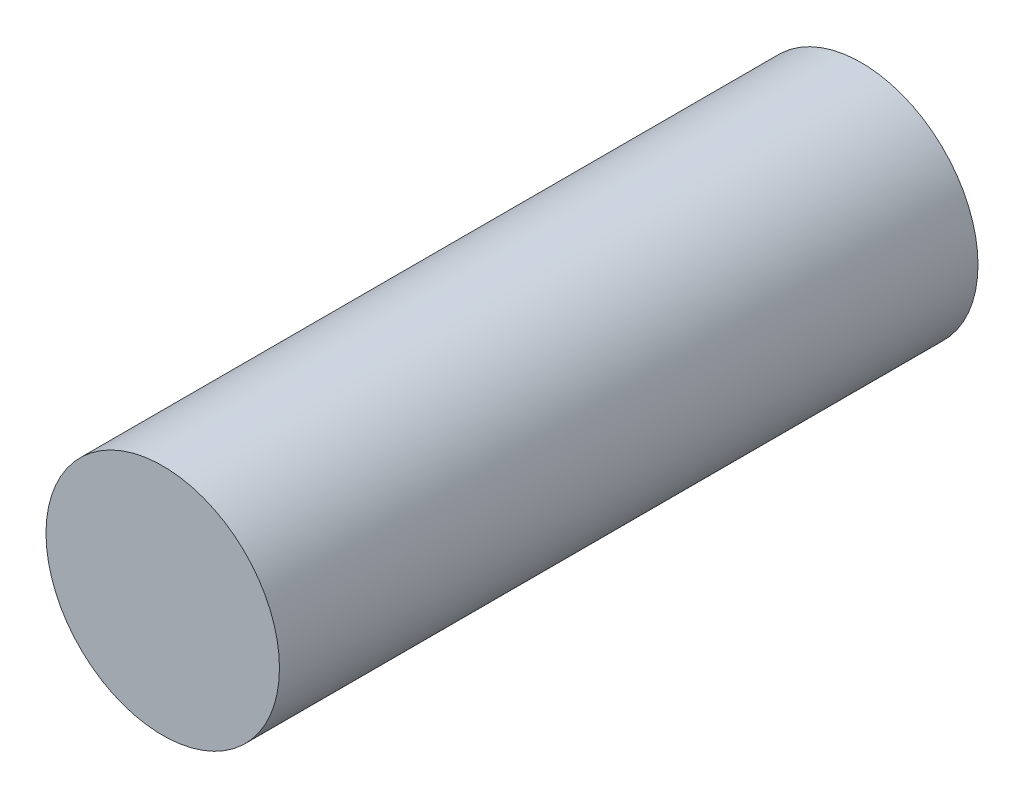
ISO-10303-21;
HEADER;
FILE_DESCRIPTION(('STEP AP214'),'2;1');
FILE_NAME('part.step','',(''),(''),'','','');
FILE_SCHEMA(('AUTOMOTIVE_DESIGN { 1 0 10303 214 1 1 1 1 }'));
ENDSEC;
DATA;
#1=APPLICATION_CONTEXT('core data for automotive mechanical design processes');
#2=APPLICATION_PROTOCOL_DEFINITION('international standard','automotive_design',2000,#1);
#3=PRODUCT_CONTEXT('',#1,'mechanical');
#4=PRODUCT('Part','Part','',(#3));
#5=PRODUCT_RELATED_PRODUCT_CATEGORY('part','',(#4));
#6=PRODUCT_DEFINITION_FORMATION('','',#4);
#7=PRODUCT_DEFINITION_CONTEXT('part definition',#1,'design');
#8=PRODUCT_DEFINITION('design','',#6,#7);
#9=PRODUCT_DEFINITION_SHAPE('','',#8);
#10=(LENGTH_UNIT() NAMED_UNIT(*) SI_UNIT(.MILLI.,.METRE.));
#11=(NAMED_UNIT(*) PLANE_ANGLE_UNIT() SI_UNIT($,.RADIAN.));
#12=(NAMED_UNIT(*) SI_UNIT($,.STERADIAN.) SOLID_ANGLE_UNIT());
#13=UNCERTAINTY_MEASURE_WITH_UNIT(LENGTH_MEASURE(1.E-05),#10,'distance_accuracy_value','');
#14=(GEOMETRIC_REPRESENTATION_CONTEXT(3) GLOBAL_UNCERTAINTY_ASSIGNED_CONTEXT((#13)) GLOBAL_UNIT_ASSIGNED_CONTEXT((#10,
#11,#12)) REPRESENTATION_CONTEXT('',''));
#15=CARTESIAN_POINT('',(0.,0.,0.));
#16=DIRECTION('',(0.,0.,1.));
#17=DIRECTION('',(1.,0.,0.));
#18=AXIS2_PLACEMENT_3D('',#15,#16,#17);
#19=CARTESIAN_POINT('',(0.,0.,19.));
#20=DIRECTION('',(0.,0.,-1.));
#21=DIRECTION('',(-1.,0.,0.));
#22=AXIS2_PLACEMENT_3D('',#19,#20,#21);
#23=PLANE('',#22);
#24=CARTESIAN_POINT('',(0.,0.,19.));
#25=DIRECTION('',(0.,0.,1.));
#26=DIRECTION('',(1.,0.,0.));
#27=AXIS2_PLACEMENT_3D('',#24,#25,#26);
#28=CIRCLE('',#27,3.175);
#29=CARTESIAN_POINT('',(3.175,0.,19.));
#30=VERTEX_POINT('',#29);
#31=EDGE_CURVE('E18',#30,#30,#28,.F.);
#32=ORIENTED_EDGE('',*,*,#31,.F.);
#33=EDGE_LOOP('',(#32));
#34=FACE_BOUND('',#33,.T.);
#35=ADVANCED_FACE('F15',(#34),#23,.F.);
#36=CARTESIAN_POINT('',(0.,0.,0.));
#37=DIRECTION('',(0.,0.,-1.));
#38=DIRECTION('',(-1.,0.,0.));
#39=AXIS2_PLACEMENT_3D('',#36,#37,#38);
#40=PLANE('',#39);
#41=CARTESIAN_POINT('',(0.,0.,0.));
#42=DIRECTION('',(0.,0.,1.));
#43=DIRECTION('',(1.,0.,0.));
#44=AXIS2_PLACEMENT_3D('',#41,#42,#43);
#45=CIRCLE('',#44,3.175);
#46=CARTESIAN_POINT('',(3.175,0.,0.));
#47=VERTEX_POINT('',#46);
#48=EDGE_CURVE('E10',#47,#47,#45,.T.);
#49=ORIENTED_EDGE('',*,*,#48,.F.);
#50=EDGE_LOOP('',(#49));
#51=FACE_BOUND('',#50,.T.);
#52=ADVANCED_FACE('F30',(#51),#40,.T.);
#53=CARTESIAN_POINT('',(0.,0.,0.));
#54=DIRECTION('',(0.,0.,1.));
#55=DIRECTION('',(1.,0.,0.));
#56=AXIS2_PLACEMENT_3D('',#53,#54,#55);
#57=CYLINDRICAL_SURFACE('',#56,3.175);
#58=ORIENTED_EDGE('',*,*,#48,.T.);
#59=EDGE_LOOP('',(#58));
#60=FACE_BOUND('',#59,.T.);
#61=ORIENTED_EDGE('',*,*,#31,.T.);
#62=EDGE_LOOP('',(#61));
#63=FACE_BOUND('',#62,.T.);
#64=ADVANCED_FACE('F27',(#60,#63),#57,.T.);
#65=CLOSED_SHELL('',(#35,#52,#64));
#66=MANIFOLD_SOLID_BREP('B1',#65);
#67=ADVANCED_BREP_SHAPE_REPRESENTATION('',(#18,#66),#14);
#68=SHAPE_DEFINITION_REPRESENTATION(#9,#67);
ENDSEC;
END-ISO-10303-21;
